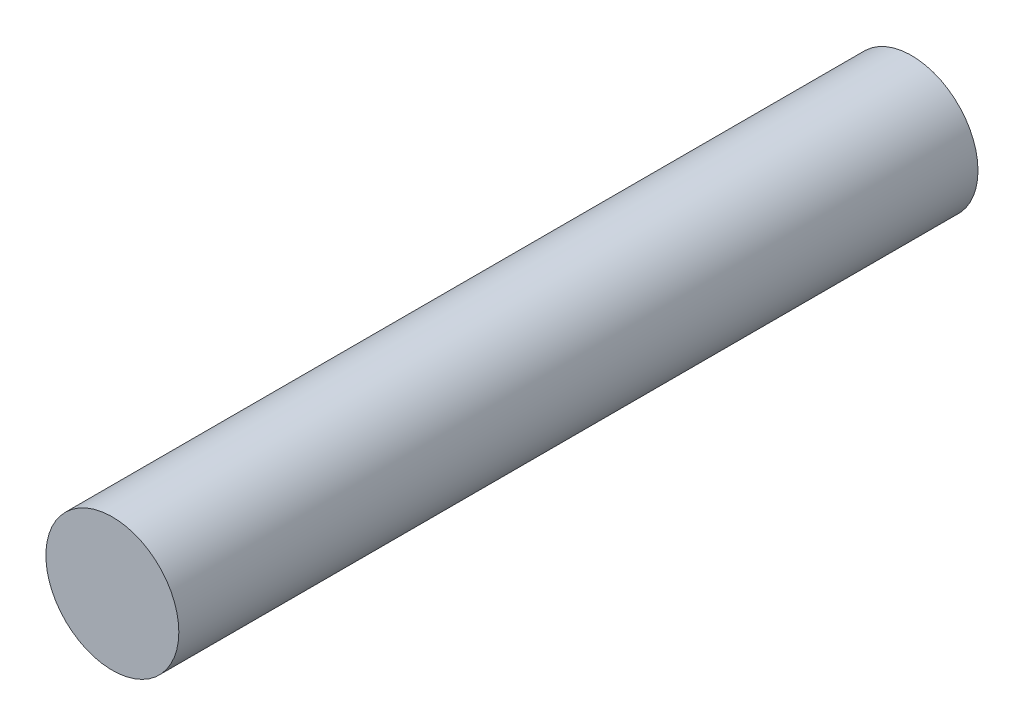
ISO-10303-21;
HEADER;
FILE_DESCRIPTION(('STEP AP214'),'2;1');
FILE_NAME('part.step','',(''),(''),'','','');
FILE_SCHEMA(('AUTOMOTIVE_DESIGN { 1 0 10303 214 1 1 1 1 }'));
ENDSEC;
DATA;
#1=APPLICATION_CONTEXT('core data for automotive mechanical design processes');
#2=APPLICATION_PROTOCOL_DEFINITION('international standard','automotive_design',2000,#1);
#3=PRODUCT_CONTEXT('',#1,'mechanical');
#4=PRODUCT('Part','Part','',(#3));
#5=PRODUCT_RELATED_PRODUCT_CATEGORY('part','',(#4));
#6=PRODUCT_DEFINITION_FORMATION('','',#4);
#7=PRODUCT_DEFINITION_CONTEXT('part definition',#1,'design');
#8=PRODUCT_DEFINITION('design','',#6,#7);
#9=PRODUCT_DEFINITION_SHAPE('','',#8);
#10=(LENGTH_UNIT() NAMED_UNIT(*) SI_UNIT(.MILLI.,.METRE.));
#11=(NAMED_UNIT(*) PLANE_ANGLE_UNIT() SI_UNIT($,.RADIAN.));
#12=(NAMED_UNIT(*) SI_UNIT($,.STERADIAN.) SOLID_ANGLE_UNIT());
#13=UNCERTAINTY_MEASURE_WITH_UNIT(LENGTH_MEASURE(1.E-05),#10,'distance_accuracy_value','');
#14=(GEOMETRIC_REPRESENTATION_CONTEXT(3) GLOBAL_UNCERTAINTY_ASSIGNED_CONTEXT((#13)) GLOBAL_UNIT_ASSIGNED_CONTEXT((#10,
#11,#12)) REPRESENTATION_CONTEXT('',''));
#15=CARTESIAN_POINT('',(0.,0.,0.));
#16=DIRECTION('',(0.,0.,1.));
#17=DIRECTION('',(1.,0.,0.));
#18=AXIS2_PLACEMENT_3D('',#15,#16,#17);
#19=CARTESIAN_POINT('',(0.,0.,150.));
#20=DIRECTION('',(0.,0.,-1.));
#21=DIRECTION('',(-1.,0.,0.));
#22=AXIS2_PLACEMENT_3D('',#19,#20,#21);
#23=CYLINDRICAL_SURFACE('',#22,12.47648);
#24=CARTESIAN_POINT('',(0.,0.,150.));
#25=DIRECTION('',(0.,0.,1.));
#26=DIRECTION('',(1.,0.,0.));
#27=AXIS2_PLACEMENT_3D('',#24,#25,#26);
#28=CIRCLE('',#27,12.47648);
#29=CARTESIAN_POINT('',(12.47648,0.,150.));
#30=VERTEX_POINT('',#29);
#31=EDGE_CURVE('E10',#30,#30,#28,.T.);
#32=ORIENTED_EDGE('',*,*,#31,.F.);
#33=EDGE_LOOP('',(#32));
#34=FACE_BOUND('',#33,.T.);
#35=CARTESIAN_POINT('',(0.,0.,0.));
#36=DIRECTION('',(0.,0.,1.));
#37=DIRECTION('',(1.,0.,0.));
#38=AXIS2_PLACEMENT_3D('',#35,#36,#37);
#39=CIRCLE('',#38,12.47648);
#40=CARTESIAN_POINT('',(12.47648,0.,0.));
#41=VERTEX_POINT('',#40);
#42=EDGE_CURVE('E34',#41,#41,#39,.T.);
#43=ORIENTED_EDGE('',*,*,#42,.T.);
#44=EDGE_LOOP('',(#43));
#45=FACE_BOUND('',#44,.T.);
#46=ADVANCED_FACE('F31',(#34,#45),#23,.T.);
#47=CARTESIAN_POINT('',(0.,0.,150.));
#48=DIRECTION('',(0.,0.,1.));
#49=DIRECTION('',(1.,0.,0.));
#50=AXIS2_PLACEMENT_3D('',#47,#48,#49);
#51=PLANE('',#50);
#52=ORIENTED_EDGE('',*,*,#31,.T.);
#53=EDGE_LOOP('',(#52));
#54=FACE_BOUND('',#53,.T.);
#55=ADVANCED_FACE('F46',(#54),#51,.T.);
#56=CARTESIAN_POINT('',(0.,0.,0.));
#57=DIRECTION('',(0.,0.,1.));
#58=DIRECTION('',(1.,0.,0.));
#59=AXIS2_PLACEMENT_3D('',#56,#57,#58);
#60=PLANE('',#59);
#61=ORIENTED_EDGE('',*,*,#42,.F.);
#62=EDGE_LOOP('',(#61));
#63=FACE_BOUND('',#62,.T.);
#64=ADVANCED_FACE('F44',(#63),#60,.F.);
#65=CLOSED_SHELL('',(#46,#55,#64));
#66=MANIFOLD_SOLID_BREP('B2',#65);
#67=ADVANCED_BREP_SHAPE_REPRESENTATION('',(#18,#66),#14);
#68=SHAPE_DEFINITION_REPRESENTATION(#9,#67);
ENDSEC;
END-ISO-10303-21;
